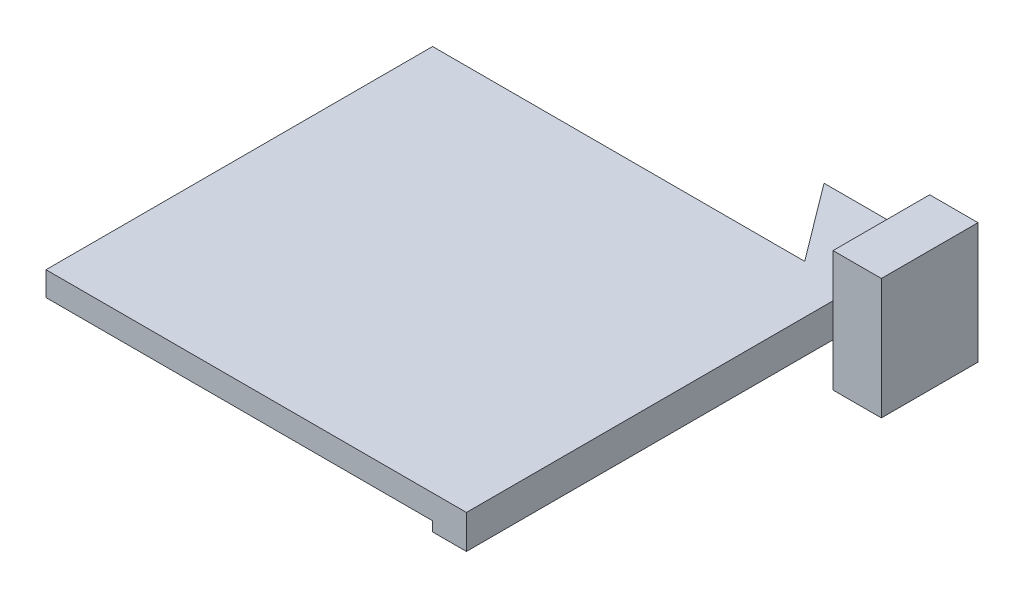
ISO-10303-21;
HEADER;
FILE_DESCRIPTION(('STEP AP214'),'2;1');
FILE_NAME('part.step','',(''),(''),'','','');
FILE_SCHEMA(('AUTOMOTIVE_DESIGN { 1 0 10303 214 1 1 1 1 }'));
ENDSEC;
DATA;
#1=APPLICATION_CONTEXT('core data for automotive mechanical design processes');
#2=APPLICATION_PROTOCOL_DEFINITION('international standard','automotive_design',2000,#1);
#3=PRODUCT_CONTEXT('',#1,'mechanical');
#4=PRODUCT('Part','Part','',(#3));
#5=PRODUCT_RELATED_PRODUCT_CATEGORY('part','',(#4));
#6=PRODUCT_DEFINITION_FORMATION('','',#4);
#7=PRODUCT_DEFINITION_CONTEXT('part definition',#1,'design');
#8=PRODUCT_DEFINITION('design','',#6,#7);
#9=PRODUCT_DEFINITION_SHAPE('','',#8);
#10=(LENGTH_UNIT() NAMED_UNIT(*) SI_UNIT(.MILLI.,.METRE.));
#11=(NAMED_UNIT(*) PLANE_ANGLE_UNIT() SI_UNIT($,.RADIAN.));
#12=(NAMED_UNIT(*) SI_UNIT($,.STERADIAN.) SOLID_ANGLE_UNIT());
#13=UNCERTAINTY_MEASURE_WITH_UNIT(LENGTH_MEASURE(1.E-05),#10,'distance_accuracy_value','');
#14=(GEOMETRIC_REPRESENTATION_CONTEXT(3) GLOBAL_UNCERTAINTY_ASSIGNED_CONTEXT((#13)) GLOBAL_UNIT_ASSIGNED_CONTEXT((#10,
#11,#12)) REPRESENTATION_CONTEXT('',''));
#15=CARTESIAN_POINT('',(0.,0.,0.));
#16=DIRECTION('',(0.,0.,1.));
#17=DIRECTION('',(1.,0.,0.));
#18=AXIS2_PLACEMENT_3D('',#15,#16,#17);
#19=CARTESIAN_POINT('',(3.5,-3.5,100.));
#20=DIRECTION('',(-1.,0.,0.));
#21=DIRECTION('',(0.,0.,1.));
#22=AXIS2_PLACEMENT_3D('',#19,#20,#21);
#23=PLANE('',#22);
#24=DIRECTION('',(0.,-1.,0.));
#25=VECTOR('',#24,1.);
#26=CARTESIAN_POINT('',(3.5,-12.5,24.1373205274606));
#27=LINE('',#26,#25);
#28=CARTESIAN_POINT('',(3.5,3.5,24.1373205274606));
#29=VERTEX_POINT('',#28);
#30=CARTESIAN_POINT('',(3.5,-3.5,24.1373205274606));
#31=VERTEX_POINT('',#30);
#32=EDGE_CURVE('E11',#29,#31,#27,.T.);
#33=ORIENTED_EDGE('',*,*,#32,.F.);
#34=DIRECTION('',(0.,0.,-1.));
#35=VECTOR('',#34,1.);
#36=CARTESIAN_POINT('',(3.5,3.5,100.));
#37=LINE('',#36,#35);
#38=CARTESIAN_POINT('',(3.5,3.5,100.));
#39=VERTEX_POINT('',#38);
#40=EDGE_CURVE('E36',#39,#29,#37,.T.);
#41=ORIENTED_EDGE('',*,*,#40,.F.);
#42=DIRECTION('',(0.,1.,0.));
#43=VECTOR('',#42,1.);
#44=CARTESIAN_POINT('',(3.5,-3.5,100.));
#45=LINE('',#44,#43);
#46=CARTESIAN_POINT('',(3.5,-3.5,100.));
#47=VERTEX_POINT('',#46);
#48=EDGE_CURVE('E234',#47,#39,#45,.T.);
#49=ORIENTED_EDGE('',*,*,#48,.F.);
#50=DIRECTION('',(0.,0.,-1.));
#51=VECTOR('',#50,1.);
#52=CARTESIAN_POINT('',(3.5,-3.5,100.));
#53=LINE('',#52,#51);
#54=EDGE_CURVE('E255',#47,#31,#53,.T.);
#55=ORIENTED_EDGE('',*,*,#54,.T.);
#56=EDGE_LOOP('',(#33,#41,#49,#55));
#57=FACE_BOUND('',#56,.T.);
#58=ADVANCED_FACE('F33',(#57),#23,.F.);
#59=DIRECTION('',(0.,1.,0.));
#60=VECTOR('',#59,1.);
#61=CARTESIAN_POINT('',(3.5,-12.5,4.13732052746064));
#62=LINE('',#61,#60);
#63=CARTESIAN_POINT('',(3.5,-3.5,4.13732052746064));
#64=VERTEX_POINT('',#63);
#65=CARTESIAN_POINT('',(3.5,3.5,4.13732052746064));
#66=VERTEX_POINT('',#65);
#67=EDGE_CURVE('E41',#64,#66,#62,.T.);
#68=ORIENTED_EDGE('',*,*,#67,.F.);
#69=CARTESIAN_POINT('',(3.5,-3.5,0.));
#70=VERTEX_POINT('',#69);
#71=EDGE_CURVE('E244',#64,#70,#53,.T.);
#72=ORIENTED_EDGE('',*,*,#71,.T.);
#73=DIRECTION('',(0.,1.,0.));
#74=VECTOR('',#73,1.);
#75=CARTESIAN_POINT('',(3.5,-3.5,0.));
#76=LINE('',#75,#74);
#77=CARTESIAN_POINT('',(3.5,3.5,0.));
#78=VERTEX_POINT('',#77);
#79=EDGE_CURVE('E231',#70,#78,#76,.T.);
#80=ORIENTED_EDGE('',*,*,#79,.T.);
#81=EDGE_CURVE('E261',#66,#78,#37,.T.);
#82=ORIENTED_EDGE('',*,*,#81,.F.);
#83=EDGE_LOOP('',(#68,#72,#80,#82));
#84=FACE_BOUND('',#83,.T.);
#85=ADVANCED_FACE('F293',(#84),#23,.F.);
#86=CARTESIAN_POINT('',(-3.5,-3.5,100.));
#87=DIRECTION('',(1.,0.,0.));
#88=DIRECTION('',(0.,0.,-1.));
#89=AXIS2_PLACEMENT_3D('',#86,#87,#88);
#90=PLANE('',#89);
#91=DIRECTION('',(0.,0.,-1.));
#92=VECTOR('',#91,1.);
#93=CARTESIAN_POINT('',(-3.5,-3.5,100.));
#94=LINE('',#93,#92);
#95=CARTESIAN_POINT('',(-3.5,-3.5,4.));
#96=VERTEX_POINT('',#95);
#97=CARTESIAN_POINT('',(-3.5,-3.5,0.));
#98=VERTEX_POINT('',#97);
#99=EDGE_CURVE('E257',#96,#98,#94,.T.);
#100=ORIENTED_EDGE('',*,*,#99,.F.);
#101=DIRECTION('',(0.,-1.,0.));
#102=VECTOR('',#101,1.);
#103=CARTESIAN_POINT('',(-3.5,3.5,4.));
#104=LINE('',#103,#102);
#105=CARTESIAN_POINT('',(-3.5,3.5,4.));
#106=VERTEX_POINT('',#105);
#107=EDGE_CURVE('E193',#106,#96,#104,.T.);
#108=ORIENTED_EDGE('',*,*,#107,.F.);
#109=DIRECTION('',(0.,0.,-1.));
#110=VECTOR('',#109,1.);
#111=CARTESIAN_POINT('',(-3.5,3.5,100.));
#112=LINE('',#111,#110);
#113=CARTESIAN_POINT('',(-3.5,3.5,0.));
#114=VERTEX_POINT('',#113);
#115=EDGE_CURVE('E260',#106,#114,#112,.T.);
#116=ORIENTED_EDGE('',*,*,#115,.T.);
#117=DIRECTION('',(0.,-1.,0.));
#118=VECTOR('',#117,1.);
#119=CARTESIAN_POINT('',(-3.5,-3.5,0.));
#120=LINE('',#119,#118);
#121=EDGE_CURVE('E250',#114,#98,#120,.T.);
#122=ORIENTED_EDGE('',*,*,#121,.T.);
#123=EDGE_LOOP('',(#100,#108,#116,#122));
#124=FACE_BOUND('',#123,.T.);
#125=ADVANCED_FACE('F341',(#124),#90,.F.);
#126=CARTESIAN_POINT('',(-3.5,3.5,100.));
#127=DIRECTION('',(0.,-1.,0.));
#128=DIRECTION('',(0.,0.,-1.));
#129=AXIS2_PLACEMENT_3D('',#126,#127,#128);
#130=PLANE('',#129);
#131=ORIENTED_EDGE('',*,*,#115,.F.);
#132=DIRECTION('',(1.,0.,0.));
#133=VECTOR('',#132,1.);
#134=CARTESIAN_POINT('',(-3.5,3.5,4.));
#135=LINE('',#134,#133);
#136=CARTESIAN_POINT('',(-18.5,3.5,4.));
#137=VERTEX_POINT('',#136);
#138=EDGE_CURVE('E187',#137,#106,#135,.T.);
#139=ORIENTED_EDGE('',*,*,#138,.F.);
#140=DIRECTION('',(-0.6,0.,-0.8));
#141=VECTOR('',#140,1.);
#142=CARTESIAN_POINT('',(-18.5,3.5,4.));
#143=LINE('',#142,#141);
#144=CARTESIAN_POINT('',(-6.5,3.5,20.));
#145=VERTEX_POINT('',#144);
#146=EDGE_CURVE('E190',#145,#137,#143,.T.);
#147=ORIENTED_EDGE('',*,*,#146,.F.);
#148=DIRECTION('',(-1.,0.,0.));
#149=VECTOR('',#148,1.);
#150=CARTESIAN_POINT('',(-3.5,3.5,20.));
#151=LINE('',#150,#149);
#152=CARTESIAN_POINT('',(-83.5,3.5,20.));
#153=VERTEX_POINT('',#152);
#154=EDGE_CURVE('E201',#145,#153,#151,.T.);
#155=ORIENTED_EDGE('',*,*,#154,.T.);
#156=DIRECTION('',(0.,0.,1.));
#157=VECTOR('',#156,1.);
#158=CARTESIAN_POINT('',(-83.5,3.5,100.));
#159=LINE('',#158,#157);
#160=CARTESIAN_POINT('',(-83.5,3.5,100.));
#161=VERTEX_POINT('',#160);
#162=EDGE_CURVE('E214',#153,#161,#159,.T.);
#163=ORIENTED_EDGE('',*,*,#162,.T.);
#164=DIRECTION('',(-1.,0.,0.));
#165=VECTOR('',#164,1.);
#166=CARTESIAN_POINT('',(-3.5,3.5,100.));
#167=LINE('',#166,#165);
#168=EDGE_CURVE('E237',#39,#161,#167,.T.);
#169=ORIENTED_EDGE('',*,*,#168,.F.);
#170=ORIENTED_EDGE('',*,*,#40,.T.);
#171=EDGE_CURVE('E264',#29,#66,#37,.T.);
#172=ORIENTED_EDGE('',*,*,#171,.T.);
#173=ORIENTED_EDGE('',*,*,#81,.T.);
#174=DIRECTION('',(-1.,0.,0.));
#175=VECTOR('',#174,1.);
#176=CARTESIAN_POINT('',(-3.5,3.5,0.));
#177=LINE('',#176,#175);
#178=EDGE_CURVE('E247',#78,#114,#177,.T.);
#179=ORIENTED_EDGE('',*,*,#178,.T.);
#180=EDGE_LOOP('',(#131,#139,#147,#155,#163,#169,#170,#172,#173,#179));
#181=FACE_BOUND('',#180,.T.);
#182=ADVANCED_FACE('F292',(#181),#130,.F.);
#183=DIRECTION('',(0.,0.,-1.));
#184=VECTOR('',#183,1.);
#185=CARTESIAN_POINT('',(-3.5,-1.5,100.));
#186=LINE('',#185,#184);
#187=CARTESIAN_POINT('',(-3.5,-1.5,100.));
#188=VERTEX_POINT('',#187);
#189=CARTESIAN_POINT('',(-3.5,-1.5,20.));
#190=VERTEX_POINT('',#189);
#191=EDGE_CURVE('E210',#188,#190,#186,.T.);
#192=ORIENTED_EDGE('',*,*,#191,.T.);
#193=DIRECTION('',(0.,-1.,0.));
#194=VECTOR('',#193,1.);
#195=CARTESIAN_POINT('',(-3.5,3.5,20.));
#196=LINE('',#195,#194);
#197=CARTESIAN_POINT('',(-3.5,-3.5,20.));
#198=VERTEX_POINT('',#197);
#199=EDGE_CURVE('E206',#190,#198,#196,.T.);
#200=ORIENTED_EDGE('',*,*,#199,.T.);
#201=CARTESIAN_POINT('',(-3.5,-3.5,100.));
#202=VERTEX_POINT('',#201);
#203=EDGE_CURVE('E258',#202,#198,#94,.T.);
#204=ORIENTED_EDGE('',*,*,#203,.F.);
#205=DIRECTION('',(0.,-1.,0.));
#206=VECTOR('',#205,1.);
#207=CARTESIAN_POINT('',(-3.5,-3.5,100.));
#208=LINE('',#207,#206);
#209=EDGE_CURVE('E240',#188,#202,#208,.T.);
#210=ORIENTED_EDGE('',*,*,#209,.F.);
#211=EDGE_LOOP('',(#192,#200,#204,#210));
#212=FACE_BOUND('',#211,.T.);
#213=ADVANCED_FACE('F346',(#212),#90,.F.);
#214=CARTESIAN_POINT('',(-3.5,-3.5,100.));
#215=DIRECTION('',(0.,1.,0.));
#216=DIRECTION('',(0.,0.,1.));
#217=AXIS2_PLACEMENT_3D('',#214,#215,#216);
#218=PLANE('',#217);
#219=DIRECTION('',(1.,0.,0.));
#220=VECTOR('',#219,1.);
#221=CARTESIAN_POINT('',(-3.5,-3.5,0.));
#222=LINE('',#221,#220);
#223=EDGE_CURVE('E238',#98,#70,#222,.T.);
#224=ORIENTED_EDGE('',*,*,#223,.T.);
#225=ORIENTED_EDGE('',*,*,#71,.F.);
#226=EDGE_CURVE('E57',#31,#64,#53,.T.);
#227=ORIENTED_EDGE('',*,*,#226,.F.);
#228=ORIENTED_EDGE('',*,*,#54,.F.);
#229=DIRECTION('',(1.,0.,0.));
#230=VECTOR('',#229,1.);
#231=CARTESIAN_POINT('',(-3.5,-3.5,100.));
#232=LINE('',#231,#230);
#233=EDGE_CURVE('E242',#202,#47,#232,.T.);
#234=ORIENTED_EDGE('',*,*,#233,.F.);
#235=ORIENTED_EDGE('',*,*,#203,.T.);
#236=DIRECTION('',(-1.,0.,0.));
#237=VECTOR('',#236,1.);
#238=CARTESIAN_POINT('',(-3.5,-3.5,20.));
#239=LINE('',#238,#237);
#240=CARTESIAN_POINT('',(-6.5,-3.5,20.));
#241=VERTEX_POINT('',#240);
#242=EDGE_CURVE('E181',#198,#241,#239,.T.);
#243=ORIENTED_EDGE('',*,*,#242,.T.);
#244=DIRECTION('',(-0.6,0.,-0.8));
#245=VECTOR('',#244,1.);
#246=CARTESIAN_POINT('',(-18.5,-3.5,4.));
#247=LINE('',#246,#245);
#248=CARTESIAN_POINT('',(-18.5,-3.5,4.));
#249=VERTEX_POINT('',#248);
#250=EDGE_CURVE('E191',#241,#249,#247,.T.);
#251=ORIENTED_EDGE('',*,*,#250,.T.);
#252=DIRECTION('',(1.,0.,0.));
#253=VECTOR('',#252,1.);
#254=CARTESIAN_POINT('',(-3.5,-3.5,4.));
#255=LINE('',#254,#253);
#256=EDGE_CURVE('E178',#249,#96,#255,.T.);
#257=ORIENTED_EDGE('',*,*,#256,.T.);
#258=ORIENTED_EDGE('',*,*,#99,.T.);
#259=EDGE_LOOP('',(#224,#225,#227,#228,#234,#235,#243,#251,#257,#258));
#260=FACE_BOUND('',#259,.T.);
#261=ADVANCED_FACE('F352',(#260),#218,.F.);
#262=CARTESIAN_POINT('',(0.,0.,100.));
#263=DIRECTION('',(0.,0.,-1.));
#264=DIRECTION('',(-1.,0.,0.));
#265=AXIS2_PLACEMENT_3D('',#262,#263,#264);
#266=PLANE('',#265);
#267=ORIENTED_EDGE('',*,*,#48,.T.);
#268=ORIENTED_EDGE('',*,*,#168,.T.);
#269=DIRECTION('',(0.,1.,0.));
#270=VECTOR('',#269,1.);
#271=CARTESIAN_POINT('',(-83.5,-1.5,100.));
#272=LINE('',#271,#270);
#273=CARTESIAN_POINT('',(-83.5,-1.5,100.));
#274=VERTEX_POINT('',#273);
#275=EDGE_CURVE('E228',#274,#161,#272,.T.);
#276=ORIENTED_EDGE('',*,*,#275,.F.);
#277=DIRECTION('',(1.,0.,0.));
#278=VECTOR('',#277,1.);
#279=CARTESIAN_POINT('',(-3.5,-1.5,100.));
#280=LINE('',#279,#278);
#281=EDGE_CURVE('E221',#274,#188,#280,.T.);
#282=ORIENTED_EDGE('',*,*,#281,.T.);
#283=ORIENTED_EDGE('',*,*,#209,.T.);
#284=ORIENTED_EDGE('',*,*,#233,.T.);
#285=EDGE_LOOP('',(#267,#268,#276,#282,#283,#284));
#286=FACE_BOUND('',#285,.T.);
#287=ADVANCED_FACE('F318',(#286),#266,.F.);
#288=CARTESIAN_POINT('',(0.,0.,0.));
#289=DIRECTION('',(0.,0.,-1.));
#290=DIRECTION('',(-1.,0.,0.));
#291=AXIS2_PLACEMENT_3D('',#288,#289,#290);
#292=PLANE('',#291);
#293=ORIENTED_EDGE('',*,*,#79,.F.);
#294=ORIENTED_EDGE('',*,*,#223,.F.);
#295=ORIENTED_EDGE('',*,*,#121,.F.);
#296=ORIENTED_EDGE('',*,*,#178,.F.);
#297=EDGE_LOOP('',(#293,#294,#295,#296));
#298=FACE_BOUND('',#297,.T.);
#299=ADVANCED_FACE('F297',(#298),#292,.T.);
#300=CARTESIAN_POINT('',(-83.5,-1.5,100.));
#301=DIRECTION('',(-1.,0.,0.));
#302=DIRECTION('',(0.,0.,1.));
#303=AXIS2_PLACEMENT_3D('',#300,#301,#302);
#304=PLANE('',#303);
#305=ORIENTED_EDGE('',*,*,#162,.F.);
#306=DIRECTION('',(0.,1.,0.));
#307=VECTOR('',#306,1.);
#308=CARTESIAN_POINT('',(-83.5,-1.5,20.));
#309=LINE('',#308,#307);
#310=CARTESIAN_POINT('',(-83.5,-1.5,20.));
#311=VERTEX_POINT('',#310);
#312=EDGE_CURVE('E224',#311,#153,#309,.T.);
#313=ORIENTED_EDGE('',*,*,#312,.F.);
#314=DIRECTION('',(0.,0.,1.));
#315=VECTOR('',#314,1.);
#316=CARTESIAN_POINT('',(-83.5,-1.5,100.));
#317=LINE('',#316,#315);
#318=EDGE_CURVE('E218',#311,#274,#317,.T.);
#319=ORIENTED_EDGE('',*,*,#318,.T.);
#320=ORIENTED_EDGE('',*,*,#275,.T.);
#321=EDGE_LOOP('',(#305,#313,#319,#320));
#322=FACE_BOUND('',#321,.T.);
#323=ADVANCED_FACE('F315',(#322),#304,.T.);
#324=CARTESIAN_POINT('',(-3.5,-1.5,20.));
#325=DIRECTION('',(0.,0.,-1.));
#326=DIRECTION('',(-1.,0.,0.));
#327=AXIS2_PLACEMENT_3D('',#324,#325,#326);
#328=PLANE('',#327);
#329=DIRECTION('',(0.,-1.,0.));
#330=VECTOR('',#329,1.);
#331=CARTESIAN_POINT('',(-6.5,3.5,20.));
#332=LINE('',#331,#330);
#333=CARTESIAN_POINT('',(-6.5,-1.5,20.));
#334=VERTEX_POINT('',#333);
#335=EDGE_CURVE('E202',#145,#334,#332,.T.);
#336=ORIENTED_EDGE('',*,*,#335,.T.);
#337=DIRECTION('',(-1.,0.,0.));
#338=VECTOR('',#337,1.);
#339=CARTESIAN_POINT('',(-3.5,-1.5,20.));
#340=LINE('',#339,#338);
#341=EDGE_CURVE('E213',#334,#311,#340,.T.);
#342=ORIENTED_EDGE('',*,*,#341,.T.);
#343=ORIENTED_EDGE('',*,*,#312,.T.);
#344=ORIENTED_EDGE('',*,*,#154,.F.);
#345=EDGE_LOOP('',(#336,#342,#343,#344));
#346=FACE_BOUND('',#345,.T.);
#347=ADVANCED_FACE('F312',(#346),#328,.T.);
#348=CARTESIAN_POINT('',(0.,-1.5,0.));
#349=DIRECTION('',(0.,1.,0.));
#350=DIRECTION('',(0.,0.,1.));
#351=AXIS2_PLACEMENT_3D('',#348,#349,#350);
#352=PLANE('',#351);
#353=ORIENTED_EDGE('',*,*,#191,.F.);
#354=ORIENTED_EDGE('',*,*,#281,.F.);
#355=ORIENTED_EDGE('',*,*,#318,.F.);
#356=ORIENTED_EDGE('',*,*,#341,.F.);
#357=EDGE_CURVE('E215',#190,#334,#340,.T.);
#358=ORIENTED_EDGE('',*,*,#357,.F.);
#359=EDGE_LOOP('',(#353,#354,#355,#356,#358));
#360=FACE_BOUND('',#359,.T.);
#361=ADVANCED_FACE('F363',(#360),#352,.F.);
#362=CARTESIAN_POINT('',(-3.5,3.5,20.));
#363=DIRECTION('',(0.,0.,1.));
#364=DIRECTION('',(1.,0.,0.));
#365=AXIS2_PLACEMENT_3D('',#362,#363,#364);
#366=PLANE('',#365);
#367=ORIENTED_EDGE('',*,*,#357,.T.);
#368=EDGE_CURVE('E205',#334,#241,#332,.T.);
#369=ORIENTED_EDGE('',*,*,#368,.T.);
#370=ORIENTED_EDGE('',*,*,#242,.F.);
#371=ORIENTED_EDGE('',*,*,#199,.F.);
#372=EDGE_LOOP('',(#367,#369,#370,#371));
#373=FACE_BOUND('',#372,.T.);
#374=ADVANCED_FACE('F362',(#373),#366,.T.);
#375=CARTESIAN_POINT('',(-3.5,3.5,4.));
#376=DIRECTION('',(0.,0.,-1.));
#377=DIRECTION('',(-1.,0.,0.));
#378=AXIS2_PLACEMENT_3D('',#375,#376,#377);
#379=PLANE('',#378);
#380=ORIENTED_EDGE('',*,*,#256,.F.);
#381=DIRECTION('',(0.,-1.,0.));
#382=VECTOR('',#381,1.);
#383=CARTESIAN_POINT('',(-18.5,3.5,4.));
#384=LINE('',#383,#382);
#385=EDGE_CURVE('E199',#137,#249,#384,.T.);
#386=ORIENTED_EDGE('',*,*,#385,.F.);
#387=ORIENTED_EDGE('',*,*,#138,.T.);
#388=ORIENTED_EDGE('',*,*,#107,.T.);
#389=EDGE_LOOP('',(#380,#386,#387,#388));
#390=FACE_BOUND('',#389,.T.);
#391=ADVANCED_FACE('F303',(#390),#379,.T.);
#392=CARTESIAN_POINT('',(-18.5,3.5,4.));
#393=DIRECTION('',(-0.8,0.,0.6));
#394=DIRECTION('',(0.6,0.,0.8));
#395=AXIS2_PLACEMENT_3D('',#392,#393,#394);
#396=PLANE('',#395);
#397=ORIENTED_EDGE('',*,*,#250,.F.);
#398=ORIENTED_EDGE('',*,*,#368,.F.);
#399=ORIENTED_EDGE('',*,*,#335,.F.);
#400=ORIENTED_EDGE('',*,*,#146,.T.);
#401=ORIENTED_EDGE('',*,*,#385,.T.);
#402=EDGE_LOOP('',(#397,#398,#399,#400,#401));
#403=FACE_BOUND('',#402,.T.);
#404=ADVANCED_FACE('F306',(#403),#396,.T.);
#405=CARTESIAN_POINT('',(3.5,0.,0.));
#406=DIRECTION('',(1.,0.,0.));
#407=DIRECTION('',(0.,0.,-1.));
#408=AXIS2_PLACEMENT_3D('',#405,#406,#407);
#409=PLANE('',#408);
#410=CARTESIAN_POINT('',(3.5,-12.5,24.1373205274606));
#411=VERTEX_POINT('',#410);
#412=EDGE_CURVE('E44',#31,#411,#27,.T.);
#413=ORIENTED_EDGE('',*,*,#412,.F.);
#414=ORIENTED_EDGE('',*,*,#226,.T.);
#415=CARTESIAN_POINT('',(3.5,-12.5,4.13732052746064));
#416=VERTEX_POINT('',#415);
#417=EDGE_CURVE('E271',#416,#64,#62,.T.);
#418=ORIENTED_EDGE('',*,*,#417,.F.);
#419=DIRECTION('',(0.,0.,-1.));
#420=VECTOR('',#419,1.);
#421=CARTESIAN_POINT('',(3.5,-12.5,4.13732052746064));
#422=LINE('',#421,#420);
#423=EDGE_CURVE('E277',#411,#416,#422,.T.);
#424=ORIENTED_EDGE('',*,*,#423,.F.);
#425=EDGE_LOOP('',(#413,#414,#418,#424));
#426=FACE_BOUND('',#425,.T.);
#427=ADVANCED_FACE('F324',(#426),#409,.F.);
#428=CARTESIAN_POINT('',(13.5,-12.5,24.1373205274606));
#429=DIRECTION('',(0.,0.,-1.));
#430=DIRECTION('',(0.,1.,0.));
#431=AXIS2_PLACEMENT_3D('',#428,#429,#430);
#432=PLANE('',#431);
#433=CARTESIAN_POINT('',(3.5,12.5,24.1373205274606));
#434=VERTEX_POINT('',#433);
#435=EDGE_CURVE('E43',#434,#29,#27,.T.);
#436=ORIENTED_EDGE('',*,*,#435,.T.);
#437=ORIENTED_EDGE('',*,*,#32,.T.);
#438=ORIENTED_EDGE('',*,*,#412,.T.);
#439=DIRECTION('',(-1.,0.,0.));
#440=VECTOR('',#439,1.);
#441=CARTESIAN_POINT('',(13.5,-12.5,24.1373205274606));
#442=LINE('',#441,#440);
#443=CARTESIAN_POINT('',(13.5,-12.5,24.1373205274606));
#444=VERTEX_POINT('',#443);
#445=EDGE_CURVE('E157',#444,#411,#442,.T.);
#446=ORIENTED_EDGE('',*,*,#445,.F.);
#447=DIRECTION('',(0.,-1.,0.));
#448=VECTOR('',#447,1.);
#449=CARTESIAN_POINT('',(13.5,-12.5,24.1373205274606));
#450=LINE('',#449,#448);
#451=CARTESIAN_POINT('',(13.5,12.5,24.1373205274606));
#452=VERTEX_POINT('',#451);
#453=EDGE_CURVE('E163',#452,#444,#450,.T.);
#454=ORIENTED_EDGE('',*,*,#453,.F.);
#455=DIRECTION('',(-1.,0.,0.));
#456=VECTOR('',#455,1.);
#457=CARTESIAN_POINT('',(13.5,12.5,24.1373205274606));
#458=LINE('',#457,#456);
#459=EDGE_CURVE('E283',#452,#434,#458,.T.);
#460=ORIENTED_EDGE('',*,*,#459,.T.);
#461=EDGE_LOOP('',(#436,#437,#438,#446,#454,#460));
#462=FACE_BOUND('',#461,.T.);
#463=ADVANCED_FACE('F175',(#462),#432,.F.);
#464=CARTESIAN_POINT('',(13.5,-12.5,4.13732052746064));
#465=DIRECTION('',(0.,1.,0.));
#466=DIRECTION('',(0.,0.,1.));
#467=AXIS2_PLACEMENT_3D('',#464,#465,#466);
#468=PLANE('',#467);
#469=ORIENTED_EDGE('',*,*,#423,.T.);
#470=DIRECTION('',(-1.,0.,0.));
#471=VECTOR('',#470,1.);
#472=CARTESIAN_POINT('',(13.5,-12.5,4.13732052746064));
#473=LINE('',#472,#471);
#474=CARTESIAN_POINT('',(13.5,-12.5,4.13732052746064));
#475=VERTEX_POINT('',#474);
#476=EDGE_CURVE('E159',#475,#416,#473,.T.);
#477=ORIENTED_EDGE('',*,*,#476,.F.);
#478=DIRECTION('',(0.,0.,-1.));
#479=VECTOR('',#478,1.);
#480=CARTESIAN_POINT('',(13.5,-12.5,4.13732052746064));
#481=LINE('',#480,#479);
#482=EDGE_CURVE('E153',#444,#475,#481,.T.);
#483=ORIENTED_EDGE('',*,*,#482,.F.);
#484=ORIENTED_EDGE('',*,*,#445,.T.);
#485=EDGE_LOOP('',(#469,#477,#483,#484));
#486=FACE_BOUND('',#485,.T.);
#487=ADVANCED_FACE('F155',(#486),#468,.F.);
#488=CARTESIAN_POINT('',(13.5,-12.5,4.13732052746064));
#489=DIRECTION('',(0.,0.,1.));
#490=DIRECTION('',(1.,0.,0.));
#491=AXIS2_PLACEMENT_3D('',#488,#489,#490);
#492=PLANE('',#491);
#493=ORIENTED_EDGE('',*,*,#417,.T.);
#494=ORIENTED_EDGE('',*,*,#67,.T.);
#495=CARTESIAN_POINT('',(3.5,12.5,4.13732052746064));
#496=VERTEX_POINT('',#495);
#497=EDGE_CURVE('E272',#66,#496,#62,.T.);
#498=ORIENTED_EDGE('',*,*,#497,.T.);
#499=DIRECTION('',(-1.,0.,0.));
#500=VECTOR('',#499,1.);
#501=CARTESIAN_POINT('',(13.5,12.5,4.13732052746064));
#502=LINE('',#501,#500);
#503=CARTESIAN_POINT('',(13.5,12.5,4.13732052746064));
#504=VERTEX_POINT('',#503);
#505=EDGE_CURVE('E183',#504,#496,#502,.T.);
#506=ORIENTED_EDGE('',*,*,#505,.F.);
#507=DIRECTION('',(0.,1.,0.));
#508=VECTOR('',#507,1.);
#509=CARTESIAN_POINT('',(13.5,-12.5,4.13732052746064));
#510=LINE('',#509,#508);
#511=EDGE_CURVE('E162',#475,#504,#510,.T.);
#512=ORIENTED_EDGE('',*,*,#511,.F.);
#513=ORIENTED_EDGE('',*,*,#476,.T.);
#514=EDGE_LOOP('',(#493,#494,#498,#506,#512,#513));
#515=FACE_BOUND('',#514,.T.);
#516=ADVANCED_FACE('F284',(#515),#492,.F.);
#517=CARTESIAN_POINT('',(13.5,12.5,4.13732052746064));
#518=DIRECTION('',(0.,-1.,0.));
#519=DIRECTION('',(0.,0.,-1.));
#520=AXIS2_PLACEMENT_3D('',#517,#518,#519);
#521=PLANE('',#520);
#522=DIRECTION('',(0.,0.,1.));
#523=VECTOR('',#522,1.);
#524=CARTESIAN_POINT('',(3.5,12.5,4.13732052746064));
#525=LINE('',#524,#523);
#526=EDGE_CURVE('E172',#496,#434,#525,.T.);
#527=ORIENTED_EDGE('',*,*,#526,.T.);
#528=ORIENTED_EDGE('',*,*,#459,.F.);
#529=DIRECTION('',(0.,0.,1.));
#530=VECTOR('',#529,1.);
#531=CARTESIAN_POINT('',(13.5,12.5,4.13732052746064));
#532=LINE('',#531,#530);
#533=EDGE_CURVE('E168',#504,#452,#532,.T.);
#534=ORIENTED_EDGE('',*,*,#533,.F.);
#535=ORIENTED_EDGE('',*,*,#505,.T.);
#536=EDGE_LOOP('',(#527,#528,#534,#535));
#537=FACE_BOUND('',#536,.T.);
#538=ADVANCED_FACE('F287',(#537),#521,.F.);
#539=CARTESIAN_POINT('',(13.5,0.,0.));
#540=DIRECTION('',(1.,0.,0.));
#541=DIRECTION('',(0.,0.,-1.));
#542=AXIS2_PLACEMENT_3D('',#539,#540,#541);
#543=PLANE('',#542);
#544=ORIENTED_EDGE('',*,*,#453,.T.);
#545=ORIENTED_EDGE('',*,*,#482,.T.);
#546=ORIENTED_EDGE('',*,*,#511,.T.);
#547=ORIENTED_EDGE('',*,*,#533,.T.);
#548=EDGE_LOOP('',(#544,#545,#546,#547));
#549=FACE_BOUND('',#548,.T.);
#550=ADVANCED_FACE('F166',(#549),#543,.T.);
#551=ORIENTED_EDGE('',*,*,#171,.F.);
#552=ORIENTED_EDGE('',*,*,#435,.F.);
#553=ORIENTED_EDGE('',*,*,#526,.F.);
#554=ORIENTED_EDGE('',*,*,#497,.F.);
#555=EDGE_LOOP('',(#551,#552,#553,#554));
#556=FACE_BOUND('',#555,.T.);
#557=ADVANCED_FACE('F291',(#556),#409,.F.);
#558=CLOSED_SHELL('',(#58,#85,#125,#182,#213,#261,#287,#299,#323,#347,#361,#374,#391,#404,#427,
#463,#487,#516,#538,#550,#557));
#559=MANIFOLD_SOLID_BREP('B2',#558);
#560=ADVANCED_BREP_SHAPE_REPRESENTATION('',(#18,#559),#14);
#561=SHAPE_DEFINITION_REPRESENTATION(#9,#560);
ENDSEC;
END-ISO-10303-21;
